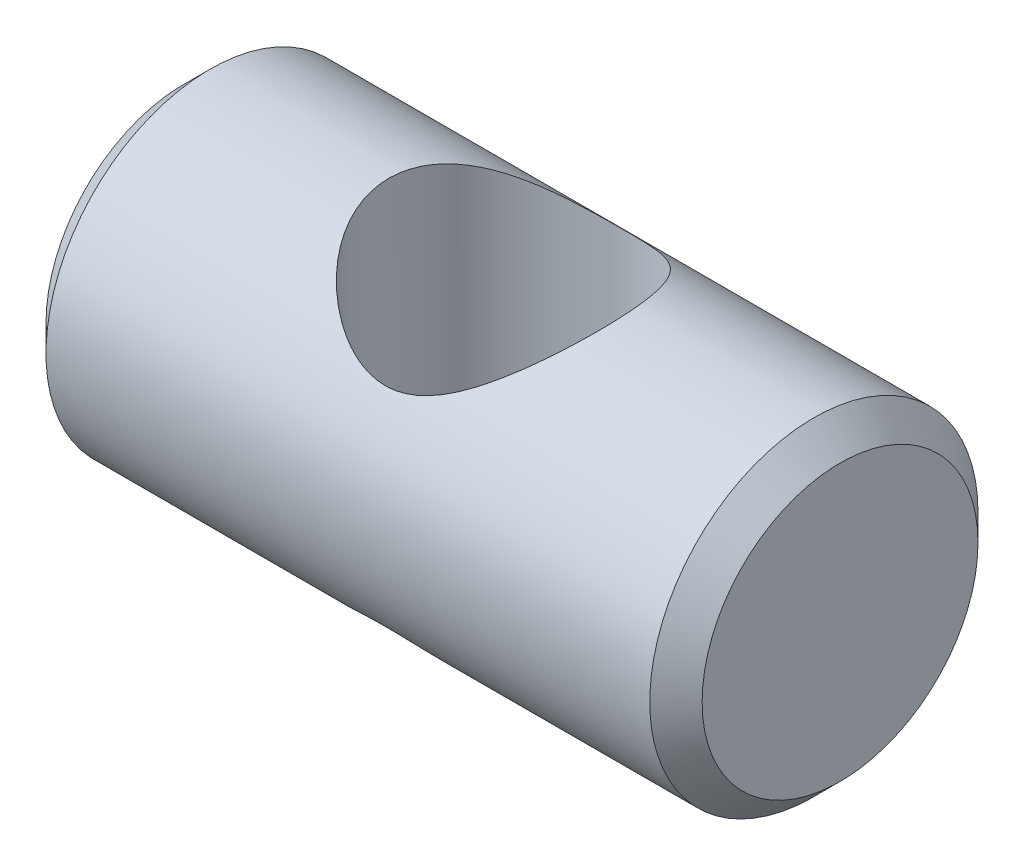
ISO-10303-21;
HEADER;
FILE_DESCRIPTION(('STEP AP214'),'2;1');
FILE_NAME('part.step','',(''),(''),'','','');
FILE_SCHEMA(('AUTOMOTIVE_DESIGN { 1 0 10303 214 1 1 1 1 }'));
ENDSEC;
DATA;
#1=APPLICATION_CONTEXT('core data for automotive mechanical design processes');
#2=APPLICATION_PROTOCOL_DEFINITION('international standard','automotive_design',2000,#1);
#3=PRODUCT_CONTEXT('',#1,'mechanical');
#4=PRODUCT('Part','Part','',(#3));
#5=PRODUCT_RELATED_PRODUCT_CATEGORY('part','',(#4));
#6=PRODUCT_DEFINITION_FORMATION('','',#4);
#7=PRODUCT_DEFINITION_CONTEXT('part definition',#1,'design');
#8=PRODUCT_DEFINITION('design','',#6,#7);
#9=PRODUCT_DEFINITION_SHAPE('','',#8);
#10=(LENGTH_UNIT() NAMED_UNIT(*) SI_UNIT(.MILLI.,.METRE.));
#11=(NAMED_UNIT(*) PLANE_ANGLE_UNIT() SI_UNIT($,.RADIAN.));
#12=(NAMED_UNIT(*) SI_UNIT($,.STERADIAN.) SOLID_ANGLE_UNIT());
#13=UNCERTAINTY_MEASURE_WITH_UNIT(LENGTH_MEASURE(1.E-05),#10,'distance_accuracy_value','');
#14=(GEOMETRIC_REPRESENTATION_CONTEXT(3) GLOBAL_UNCERTAINTY_ASSIGNED_CONTEXT((#13)) GLOBAL_UNIT_ASSIGNED_CONTEXT((#10,
#11,#12)) REPRESENTATION_CONTEXT('',''));
#15=CARTESIAN_POINT('',(0.,0.,0.));
#16=DIRECTION('',(0.,0.,1.));
#17=DIRECTION('',(1.,0.,0.));
#18=AXIS2_PLACEMENT_3D('',#15,#16,#17);
#19=CARTESIAN_POINT('',(9.525,0.,0.));
#20=DIRECTION('',(-1.,0.,0.));
#21=DIRECTION('',(0.,0.,1.));
#22=AXIS2_PLACEMENT_3D('',#19,#20,#21);
#23=CYLINDRICAL_SURFACE('',#22,4.765);
#24=CARTESIAN_POINT('',(-3.42087708051605,-4.765,0.));
#25=CARTESIAN_POINT('',(-3.42696899134863,-4.7649997101109,0.0833627581168182));
#26=CARTESIAN_POINT('',(-3.43001003086423,-4.76280757869707,0.166953392424251));
#27=CARTESIAN_POINT('',(-3.4299899120654,-4.75402028790231,0.333933182408653));
#28=CARTESIAN_POINT('',(-3.42692615604904,-4.74742325494959,0.41732223719261));
#29=CARTESIAN_POINT('',(-3.41478160746824,-4.72989865727235,0.583312250165057));
#30=CARTESIAN_POINT('',(-3.40569315136156,-4.71896558414041,0.665912068503747));
#31=CARTESIAN_POINT('',(-3.38168739143667,-4.69295834085159,0.829610597514772));
#32=CARTESIAN_POINT('',(-3.36676760565251,-4.67788240819801,0.91070865358331));
#33=CARTESIAN_POINT('',(-3.31382161536753,-4.62699847385246,1.15000632689336));
#34=CARTESIAN_POINT('',(-3.26752778272676,-4.58542013528299,1.30524951697123));
#35=CARTESIAN_POINT('',(-3.15544383432779,-4.48962808746058,1.60411463212557));
#36=CARTESIAN_POINT('',(-3.08965416222603,-4.43541466574349,1.74773682156028));
#37=CARTESIAN_POINT('',(-2.93522566350036,-4.31273538578719,2.03259497643689));
#38=CARTESIAN_POINT('',(-2.84518090003159,-4.24347672491827,2.17272279857911));
#39=CARTESIAN_POINT('',(-2.64803347355049,-4.09784606286129,2.43631552731587));
#40=CARTESIAN_POINT('',(-2.54091313456509,-4.02146672501527,2.55976291960052));
#41=CARTESIAN_POINT('',(-2.28757037498761,-3.84950291536883,2.81327393100644));
#42=CARTESIAN_POINT('',(-2.13784494064544,-3.75321839663728,2.93940806717613));
#43=CARTESIAN_POINT('',(-1.89774924473951,-3.61188607024724,3.10885207016274));
#44=CARTESIAN_POINT('',(-1.81509327318893,-3.56527135977744,3.16205944901992));
#45=CARTESIAN_POINT('',(-1.64456461914389,-3.47438917550769,3.26165283895997));
#46=CARTESIAN_POINT('',(-1.55669391813204,-3.43012082209568,3.30804141803447));
#47=CARTESIAN_POINT('',(-1.33801732923479,-3.32784018306176,3.41144333221737));
#48=CARTESIAN_POINT('',(-1.20454764001564,-3.27176419567389,3.46485738281701));
#49=CARTESIAN_POINT('',(-0.927567219273259,-3.17315327144381,3.55539465585279));
#50=CARTESIAN_POINT('',(-0.784080947165172,-3.13058666617785,3.59255605597934));
#51=CARTESIAN_POINT('',(-0.514646140223209,-3.07113542283653,3.64343651296181));
#52=CARTESIAN_POINT('',(-0.389980532152303,-3.05107413064414,3.66010628533956));
#53=CARTESIAN_POINT('',(-0.13805144197163,-3.02761567970702,3.67954153570878));
#54=CARTESIAN_POINT('',(-0.010790737951865,-3.02420155283186,3.68232117171679));
#55=CARTESIAN_POINT('',(0.242449329866106,-3.03458366659267,3.67376621747767));
#56=CARTESIAN_POINT('',(0.368429244158409,-3.04837216824954,3.66243797397314));
#57=CARTESIAN_POINT('',(0.615927376424317,-3.09094772918142,3.62657095184853));
#58=CARTESIAN_POINT('',(0.737438661719832,-3.11975712134959,3.60201250089043));
#59=CARTESIAN_POINT('',(1.02486117239319,-3.20358122773375,3.52797021750044));
#60=CARTESIAN_POINT('',(1.18741075414518,-3.26453704351351,3.47231020523667));
#61=CARTESIAN_POINT('',(1.498121783823,-3.39961296516166,3.34017866781708));
#62=CARTESIAN_POINT('',(1.64623815847782,-3.47377238661047,3.2636446149314));
#63=CARTESIAN_POINT('',(1.87825971607124,-3.60054284241464,3.12200897105521));
#64=CARTESIAN_POINT('',(1.9664324955114,-3.65156363596669,3.06234750531042));
#65=CARTESIAN_POINT('',(2.13658829521524,-3.75440484501345,2.93536296354977));
#66=CARTESIAN_POINT('',(2.21856944344932,-3.80622549668558,2.86803758566651));
#67=CARTESIAN_POINT('',(2.4548169203279,-3.96070606463684,2.65493557738645));
#68=CARTESIAN_POINT('',(2.59972905493882,-4.06258137631192,2.4978237985218));
#69=CARTESIAN_POINT('',(2.83706621766583,-4.23718725327564,2.18575837138569));
#70=CARTESIAN_POINT('',(2.93424360521689,-4.31186637762032,2.03548298499758));
#71=CARTESIAN_POINT('',(3.10568912436017,-4.44824656330391,1.71702572980925));
#72=CARTESIAN_POINT('',(3.17999040299218,-4.50996636079323,1.54887024912961));
#73=CARTESIAN_POINT('',(3.29263516387729,-4.60778480850806,1.22389848309853));
#74=CARTESIAN_POINT('',(3.33468022800881,-4.64632732736096,1.06910753325384));
#75=CARTESIAN_POINT('',(3.39687013419293,-4.70801774696666,0.752190984217971));
#76=CARTESIAN_POINT('',(3.4170259792185,-4.73117337991453,0.590069112764687));
#77=CARTESIAN_POINT('',(3.43390286080123,-4.7606051003247,0.262598143568303));
#78=CARTESIAN_POINT('',(3.43055828056669,-4.76683385814853,0.0972412962651645));
#79=CARTESIAN_POINT('',(3.40010195996678,-4.76222706928004,-0.231024129353292));
#80=CARTESIAN_POINT('',(3.37298745129903,-4.75138953488968,-0.393932420256085));
#81=CARTESIAN_POINT('',(3.29795083571309,-4.71498049061455,-0.705514268669748));
#82=CARTESIAN_POINT('',(3.25098003249397,-4.69006694126301,-0.854498752183594));
#83=CARTESIAN_POINT('',(3.13840780618742,-4.6283363468626,-1.14256413370517));
#84=CARTESIAN_POINT('',(3.07280276883643,-4.59151699239254,-1.28164310390504));
#85=CARTESIAN_POINT('',(2.91796402171938,-4.50478911028579,-1.5605913242394));
#86=CARTESIAN_POINT('',(2.82706121692328,-4.45396042558585,-1.6992420339739));
#87=CARTESIAN_POINT('',(2.62789389216064,-4.34533105232054,-1.96045324775842));
#88=CARTESIAN_POINT('',(2.51961335554432,-4.28752394420402,-2.08299871660834));
#89=CARTESIAN_POINT('',(2.26753986981794,-4.15886196775128,-2.33061071233595));
#90=CARTESIAN_POINT('',(2.12084350362776,-4.08747815085455,-2.4524560274696));
#91=CARTESIAN_POINT('',(1.80818256348861,-3.94818744226299,-2.67091966387117));
#92=CARTESIAN_POINT('',(1.64221717999394,-3.88028069682256,-2.76753692468302));
#93=CARTESIAN_POINT('',(1.32363316444147,-3.76775877390234,-2.91829752704228));
#94=CARTESIAN_POINT('',(1.17388770573105,-3.72114907301219,-2.97693831230802));
#95=CARTESIAN_POINT('',(0.94182658133829,-3.66180847873486,-3.04915600293589));
#96=CARTESIAN_POINT('',(0.863255129060431,-3.64379412637323,-3.0706008978109));
#97=CARTESIAN_POINT('',(0.703992654043785,-3.61197174564401,-3.10797188341904));
#98=CARTESIAN_POINT('',(0.62330269473567,-3.59816164910818,-3.12390068817333));
#99=CARTESIAN_POINT('',(0.459495462666014,-3.57524455910332,-3.15010468685879));
#100=CARTESIAN_POINT('',(0.376361962516611,-3.5661861203942,-3.16032158062367));
#101=CARTESIAN_POINT('',(0.209195138832908,-3.55344451616001,-3.17464168800661));
#102=CARTESIAN_POINT('',(0.125162274904953,-3.54975872585817,-3.17874788699032));
#103=CARTESIAN_POINT('',(-0.0430393452037676,-3.54795587812489,-3.18076053743013));
#104=CARTESIAN_POINT('',(-0.127208095972437,-3.54983860412504,-3.17866722999483));
#105=CARTESIAN_POINT('',(-0.29484062899608,-3.55905933774995,-3.16833758034575));
#106=CARTESIAN_POINT('',(-0.378304441298768,-3.56639711165655,-3.16010150131517));
#107=CARTESIAN_POINT('',(-0.604314657609785,-3.59341005189328,-3.129430196119));
#108=CARTESIAN_POINT('',(-0.745494317394036,-3.61818171011667,-3.10101793603989));
#109=CARTESIAN_POINT('',(-1.02069983126741,-3.67972750014127,-3.02771937958645));
#110=CARTESIAN_POINT('',(-1.1547183301723,-3.71651370639189,-2.98281650470617));
#111=CARTESIAN_POINT('',(-1.46853642894096,-3.8153502491925,-2.8560768918245));
#112=CARTESIAN_POINT('',(-1.64398166227299,-3.88152734494911,-2.76664814536404));
#113=CARTESIAN_POINT('',(-1.97551522842484,-4.02033820070584,-2.56077346334119));
#114=CARTESIAN_POINT('',(-2.13156938380249,-4.09298298410994,-2.44428083509274));
#115=CARTESIAN_POINT('',(-2.42421216807333,-4.2373970566927,-2.18450650401399));
#116=CARTESIAN_POINT('',(-2.56052605726515,-4.30914323590253,-2.04090097393914));
#117=CARTESIAN_POINT('',(-2.80802181758102,-4.44318432752427,-1.72973058522059));
#118=CARTESIAN_POINT('',(-2.91923707314103,-4.50549175797245,-1.56219804304703));
#119=CARTESIAN_POINT('',(-3.09396462152009,-4.60338031575656,-1.23969583506405));
#120=CARTESIAN_POINT('',(-3.16252149709776,-4.64178783933997,-1.08834922542924));
#121=CARTESIAN_POINT('',(-3.24875451241662,-4.68864069192958,-0.853387810710919));
#122=CARTESIAN_POINT('',(-3.27471971164357,-4.70245945854321,-0.773800863355168));
#123=CARTESIAN_POINT('',(-3.32087000112459,-4.72618391319332,-0.612411306870996));
#124=CARTESIAN_POINT('',(-3.34105760799584,-4.73609130567107,-0.530609679466056));
#125=CARTESIAN_POINT('',(-3.37353939001354,-4.75084997254152,-0.374335243630175));
#126=CARTESIAN_POINT('',(-3.38645258471521,-4.75613339853629,-0.300030947704157));
#127=CARTESIAN_POINT('',(-3.40736829831093,-4.76320900575073,-0.150546671086999));
#128=CARTESIAN_POINT('',(-3.41536951590209,-4.76500026208246,-0.075366463716097));
#129=CARTESIAN_POINT('',(-3.42087708051605,-4.765,0.));
#130=B_SPLINE_CURVE_WITH_KNOTS('',3,(#24,#25,#26,#27,#28,#29,#30,#31,#32,#33,#34,#35,#36,#37,
#38,#39,#40,#41,#42,#43,#44,#45,#46,#47,#48,#49,#50,#51,#52,#53,#54,#55,#56,#57,#58,#59,#60,#61,
#62,#63,#64,#65,#66,#67,#68,#69,#70,#71,#72,#73,#74,#75,#76,#77,#78,#79,#80,#81,#82,#83,#84,#85,
#86,#87,#88,#89,#90,#91,#92,#93,#94,#95,#96,#97,#98,#99,#100,#101,#102,#103,#104,#105,#106,#107,
#108,#109,#110,#111,#112,#113,#114,#115,#116,#117,#118,#119,#120,#121,#122,#123,#124,#125,#126,
#127,#128,#129),.UNSPECIFIED.,.T.,.F.,(4,2,2,2,2,2,2,2,2,2,2,2,2,2,2,2,2,2,2,2,2,2,2,2,2,2,2,2,
2,2,2,2,2,2,2,2,2,2,2,2,2,2,2,2,2,2,2,2,2,2,2,2,4),(0.,0.250678148817341,0.501462988541287,
0.752567445437253,1.00377889552888,1.50309474088369,2.00239922444642,2.54160992918404,
3.08138247258981,3.73300244855075,4.05909733145616,4.38506908912952,4.84654436743379,
5.30692973453839,5.68734604359481,6.06737452056514,6.44723209503533,6.82765605484285,
7.37157480546313,7.91714109472133,8.27090631470675,8.62477807035776,9.33119791439566,
9.91077027397039,10.4894988486046,10.9822712500665,11.4747958366297,11.9686961727678,
12.4626540373564,12.9352342359093,13.4079061579591,13.9261848288361,14.4449439577641,
15.0533142145202,15.6617100398796,16.1619385675779,16.4119146790501,16.6617676221917,
16.9141262556176,17.1663615593023,17.4185870532858,17.6708017414467,18.1072101440206,
18.5440584873629,19.1640002904501,19.7850197135797,20.4139885307568,21.0421157411608,
21.5513660687497,21.8056438515067,22.059810706191,22.2863833912941,22.5130160751694),.UNSPECIFIED.);
#131=CARTESIAN_POINT('',(-3.42087708051605,-4.765,0.));
#132=VERTEX_POINT('',#131);
#133=EDGE_CURVE('E10',#132,#132,#130,.T.);
#134=ORIENTED_EDGE('',*,*,#133,.T.);
#135=EDGE_LOOP('',(#134));
#136=FACE_BOUND('',#135,.T.);
#137=CARTESIAN_POINT('',(0.,3.02701585724291,3.68));
#138=CARTESIAN_POINT('',(-0.0785672773316466,3.02701614791727,3.67999984364138));
#139=CARTESIAN_POINT('',(-0.157136135576355,3.03031605642996,3.67729277636747));
#140=CARTESIAN_POINT('',(-0.313369541449519,3.04330147157753,3.66655295600809));
#141=CARTESIAN_POINT('',(-0.391034010912772,3.05298752605126,3.65851974601636));
#142=CARTESIAN_POINT('',(-0.544942339151606,3.07820352988238,3.63732812874269));
#143=CARTESIAN_POINT('',(-0.621180877977561,3.09375201630091,3.62415345944192));
#144=CARTESIAN_POINT('',(-0.771468880528867,3.12988210454059,3.59299821855179));
#145=CARTESIAN_POINT('',(-0.845516665983407,3.15046745848851,3.57501406328682));
#146=CARTESIAN_POINT('',(-1.09433047382612,3.22791462831318,3.50587087765695));
#147=CARTESIAN_POINT('',(-1.26309282362243,3.2948386580286,3.44382003292069));
#148=CARTESIAN_POINT('',(-1.50370711041474,3.40467601246938,3.33408533723919));
#149=CARTESIAN_POINT('',(-1.58189244838754,3.44290479326835,3.29468500807198));
#150=CARTESIAN_POINT('',(-1.73423285237257,3.52148653298938,3.21055545325705));
#151=CARTESIAN_POINT('',(-1.80838881793449,3.56183901380659,3.16582742418489));
#152=CARTESIAN_POINT('',(-2.02850482582811,3.68672600847628,3.02153691887044));
#153=CARTESIAN_POINT('',(-2.16807869449587,3.77315168849593,2.9137218740972));
#154=CARTESIAN_POINT('',(-2.42959010373283,3.94426933228633,2.67754924945123));
#155=CARTESIAN_POINT('',(-2.55153658554773,4.0289621561759,2.54920215427041));
#156=CARTESIAN_POINT('',(-2.77693730786715,4.1919505214112,2.27132648174838));
#157=CARTESIAN_POINT('',(-2.88023478105728,4.27018907543984,2.12163570850646));
#158=CARTESIAN_POINT('',(-3.06369900830999,4.41409842691616,1.80316374111449));
#159=CARTESIAN_POINT('',(-3.14388622560065,4.47978032533083,1.63439962117957));
#160=CARTESIAN_POINT('',(-3.26635689009236,4.58439476517905,1.30881127520956));
#161=CARTESIAN_POINT('',(-3.3126324755552,4.62591646772975,1.15433056577145));
#162=CARTESIAN_POINT('',(-3.38325654959983,4.69367027218436,0.837202280830254));
#163=CARTESIAN_POINT('',(-3.40762001451853,4.7199128126465,0.674560363681942));
#164=CARTESIAN_POINT('',(-3.43267527752513,4.75538994748078,0.345016918949486));
#165=CARTESIAN_POINT('',(-3.43328564995364,4.76456593536209,0.178102701594286));
#166=CARTESIAN_POINT('',(-3.41018166140548,4.76540378920208,-0.154080808504466));
#167=CARTESIAN_POINT('',(-3.38646547727926,4.75706434242047,-0.319349977022772));
#168=CARTESIAN_POINT('',(-3.31775156953333,4.72510260499364,-0.634317782486346));
#169=CARTESIAN_POINT('',(-3.27397352746067,4.70233080305011,-0.784375176401478));
#170=CARTESIAN_POINT('',(-3.16750864597913,4.64450941494238,-1.07505429218324));
#171=CARTESIAN_POINT('',(-3.10481828431147,4.60945754152293,-1.21567425043883));
#172=CARTESIAN_POINT('',(-2.95652856255593,4.52638674091888,-1.49677788855974));
#173=CARTESIAN_POINT('',(-2.86942133720827,4.47751111873768,-1.63620711351601));
#174=CARTESIAN_POINT('',(-2.67788120319372,4.37232420780869,-1.89951272145431));
#175=CARTESIAN_POINT('',(-2.57343424063936,4.31600689517522,-2.02337634423388));
#176=CARTESIAN_POINT('',(-2.32992989714121,4.18996971318213,-2.27426780979749));
#177=CARTESIAN_POINT('',(-2.18800876851398,4.11960732735628,-2.39819784816123));
#178=CARTESIAN_POINT('',(-1.88505782163776,3.98107848473248,-2.62174133186739));
#179=CARTESIAN_POINT('',(-1.72402241690679,3.91291267736107,-2.72134764203992));
#180=CARTESIAN_POINT('',(-1.40961518716303,3.79636450990898,-2.881168849186));
#181=CARTESIAN_POINT('',(-1.25863725138286,3.74654731116981,-2.94503209171547));
#182=CARTESIAN_POINT('',(-0.945527440392476,3.66060402226399,-3.05121747931762));
#183=CARTESIAN_POINT('',(-0.783414037013453,3.62445587601066,-3.09357436476774));
#184=CARTESIAN_POINT('',(-0.533813056438613,3.58476149841442,-3.13928376884266));
#185=CARTESIAN_POINT('',(-0.449028547115524,3.57393161480045,-3.15156761613341));
#186=CARTESIAN_POINT('',(-0.278275024285711,3.55780077117141,-3.16976872881678));
#187=CARTESIAN_POINT('',(-0.192306660171834,3.5524968934398,-3.17568935402606));
#188=CARTESIAN_POINT('',(-0.020032770904315,3.54772147962291,-3.18102355866001));
#189=CARTESIAN_POINT('',(0.0662726316081444,3.54824798964232,-3.18043931801256));
#190=CARTESIAN_POINT('',(0.238338872801625,3.55508375410915,-3.17279435887041));
#191=CARTESIAN_POINT('',(0.324099748085624,3.56139261563451,-3.16573408043507));
#192=CARTESIAN_POINT('',(0.553401842306173,3.58576306843395,-3.13816835119393));
#193=CARTESIAN_POINT('',(0.69573919740344,3.60894237647337,-3.11173256017326));
#194=CARTESIAN_POINT('',(0.973480788870408,3.6678298405413,-3.04208625520151));
#195=CARTESIAN_POINT('',(1.10887734054378,3.70355155394913,-2.99885758403296));
#196=CARTESIAN_POINT('',(1.42379146726814,3.7997001514418,-2.87675019956371));
#197=CARTESIAN_POINT('',(1.59919673865542,3.86428769996493,-2.79052654374781));
#198=CARTESIAN_POINT('',(1.93113815119942,4.00059813210694,-2.59133845951309));
#199=CARTESIAN_POINT('',(2.08764088718698,4.07233325050109,-2.47832770642991));
#200=CARTESIAN_POINT('',(2.38199709911893,4.21579037939226,-2.22570370446708));
#201=CARTESIAN_POINT('',(2.51955338419097,4.28749766673045,-2.08573466326166));
#202=CARTESIAN_POINT('',(2.77028243502779,4.42234806198233,-1.78201502187867));
#203=CARTESIAN_POINT('',(2.88349257282064,4.48550424008068,-1.61830152645774));
#204=CARTESIAN_POINT('',(3.06402610957439,4.58658548395503,-1.30045140866569));
#205=CARTESIAN_POINT('',(3.13591982023922,4.62699541781642,-1.1497087789086));
#206=CARTESIAN_POINT('',(3.25766051296821,4.69370617156705,-0.836599849304389));
#207=CARTESIAN_POINT('',(3.30752205037566,4.7200163088041,-0.674241306034806));
#208=CARTESIAN_POINT('',(3.3829870904449,4.75572615385405,-0.341241432427482));
#209=CARTESIAN_POINT('',(3.40846923089666,4.7650414665297,-0.170563063438744));
#210=CARTESIAN_POINT('',(3.4334390909829,4.76495829995348,0.172677006169809));
#211=CARTESIAN_POINT('',(3.43293306367628,4.7555643228997,0.345238243758836));
#212=CARTESIAN_POINT('',(3.40754400048731,4.71998636563285,0.67212649572784));
#213=CARTESIAN_POINT('',(3.38468468821344,4.69525837988108,0.826779473459491));
#214=CARTESIAN_POINT('',(3.31910619707247,4.63193340521078,1.12882616508402));
#215=CARTESIAN_POINT('',(3.27638180384756,4.59333277548538,1.27621796175838));
#216=CARTESIAN_POINT('',(3.17042951924722,4.50215126554465,1.5686260572414));
#217=CARTESIAN_POINT('',(3.10621371599284,4.44892473542071,1.71307815224114));
#218=CARTESIAN_POINT('',(2.96073945861412,4.33272638873523,1.98874620073681));
#219=CARTESIAN_POINT('',(2.87947919610232,4.26975353829207,2.11996074756245));
#220=CARTESIAN_POINT('',(2.68651050838254,4.12556821291774,2.39003735747662));
#221=CARTESIAN_POINT('',(2.57196063848181,4.04309554925752,2.52618739114483));
#222=CARTESIAN_POINT('',(2.32447412944916,3.87408431941462,2.77844859407009));
#223=CARTESIAN_POINT('',(2.19149095139184,3.78753584009048,2.89450731580785));
#224=CARTESIAN_POINT('',(1.96595276183287,3.65130486353125,3.06263487303052));
#225=CARTESIAN_POINT('',(1.87886470860019,3.60090149373494,3.12157066922301));
#226=CARTESIAN_POINT('',(1.69862262017005,3.50236607543005,3.23173475735497));
#227=CARTESIAN_POINT('',(1.60546616441238,3.45423494663789,3.28295994638551));
#228=CARTESIAN_POINT('',(1.41335402823623,3.36225362869259,3.37709887635029));
#229=CARTESIAN_POINT('',(1.31441341048654,3.31839304937429,3.4200330530899));
#230=CARTESIAN_POINT('',(1.11061583662532,3.23713845030014,3.49704051581634));
#231=CARTESIAN_POINT('',(1.00576424358736,3.19973868995705,3.53112168161428));
#232=CARTESIAN_POINT('',(0.826860618617418,3.1451674862639,3.57966454279998));
#233=CARTESIAN_POINT('',(0.754330914941613,3.12542579098052,3.59686794878708));
#234=CARTESIAN_POINT('',(0.607204587985835,3.09080711138969,3.62665947956898));
#235=CARTESIAN_POINT('',(0.532609008476296,3.07592771737776,3.63924989089071));
#236=CARTESIAN_POINT('',(0.38209665983941,3.05181598122002,3.65949364139542));
#237=CARTESIAN_POINT('',(0.306185151895193,3.04256489437812,3.66716337327478));
#238=CARTESIAN_POINT('',(0.153516252829605,3.03016475948479,3.67741657137031));
#239=CARTESIAN_POINT('',(0.0767588809019638,3.02701557325904,3.68000015275969));
#240=CARTESIAN_POINT('',(0.,3.02701585724291,3.68));
#241=B_SPLINE_CURVE_WITH_KNOTS('',3,(#137,#138,#139,#140,#141,#142,#143,#144,#145,#146,#147,
#148,#149,#150,#151,#152,#153,#154,#155,#156,#157,#158,#159,#160,#161,#162,#163,#164,#165,#166,
#167,#168,#169,#170,#171,#172,#173,#174,#175,#176,#177,#178,#179,#180,#181,#182,#183,#184,#185,
#186,#187,#188,#189,#190,#191,#192,#193,#194,#195,#196,#197,#198,#199,#200,#201,#202,#203,#204,
#205,#206,#207,#208,#209,#210,#211,#212,#213,#214,#215,#216,#217,#218,#219,#220,#221,#222,#223,
#224,#225,#226,#227,#228,#229,#230,#231,#232,#233,#234,#235,#236,#237,#238,#239,#240),
.UNSPECIFIED.,.T.,.F.,(4,2,2,2,2,2,2,2,2,2,2,2,2,2,2,2,2,2,2,2,2,2,2,2,2,2,2,2,2,2,2,2,2,2,2,2,
2,2,2,2,2,2,2,2,2,2,2,2,2,2,2,4),(0.,0.235591708988226,0.471203630963838,0.707566894291256,
0.944106771258296,1.51591397043087,1.80236618274396,2.08875418016066,2.67592975620556,
3.26280644257576,3.85440755326201,4.44548320346413,4.94292664174491,5.44002983205938,
5.93883694376225,6.43768144120931,6.9095606777859,7.38152785217115,7.89413675044232,
8.40716316586385,9.00813916387887,9.60929124216605,10.1214610992978,10.6328009675269,
10.8914987801306,11.1500599316432,11.4085344360666,11.6669913779457,12.1048085655683,
12.5431004643861,13.1573710774192,13.7727118402267,14.3968121302921,15.0199474601663,
15.5333029695888,16.0463188267164,16.5618754223646,17.077307969612,17.550023970907,
18.0228641248864,18.5213957266873,19.0199802486027,19.6062313855034,20.1939905554461,
20.5434646283834,20.8930789631276,21.2418202453876,21.5902500511245,21.8213124314337,
22.0522601254179,22.2824343920731,22.5126034464923),.UNSPECIFIED.);
#242=CARTESIAN_POINT('',(0.,3.02701585724291,3.68));
#243=VERTEX_POINT('',#242);
#244=EDGE_CURVE('E43',#243,#243,#241,.T.);
#245=ORIENTED_EDGE('',*,*,#244,.T.);
#246=EDGE_LOOP('',(#245));
#247=FACE_BOUND('',#246,.T.);
#248=CARTESIAN_POINT('',(-8.76499999999999,0.,0.));
#249=DIRECTION('',(1.,0.,0.));
#250=DIRECTION('',(0.,0.,-1.));
#251=AXIS2_PLACEMENT_3D('',#248,#249,#250);
#252=CIRCLE('',#251,4.765);
#253=CARTESIAN_POINT('',(-8.76499999999999,0.,-4.765));
#254=VERTEX_POINT('',#253);
#255=EDGE_CURVE('E84',#254,#254,#252,.T.);
#256=ORIENTED_EDGE('',*,*,#255,.T.);
#257=EDGE_LOOP('',(#256));
#258=FACE_BOUND('',#257,.T.);
#259=CARTESIAN_POINT('',(8.76500000000001,0.,0.));
#260=DIRECTION('',(1.,0.,0.));
#261=DIRECTION('',(0.,0.,-1.));
#262=AXIS2_PLACEMENT_3D('',#259,#260,#261);
#263=CIRCLE('',#262,4.765);
#264=CARTESIAN_POINT('',(8.76500000000001,0.,-4.765));
#265=VERTEX_POINT('',#264);
#266=EDGE_CURVE('E87',#265,#265,#263,.F.);
#267=ORIENTED_EDGE('',*,*,#266,.T.);
#268=EDGE_LOOP('',(#267));
#269=FACE_BOUND('',#268,.T.);
#270=ADVANCED_FACE('F31',(#136,#247,#258,#269),#23,.T.);
#271=CARTESIAN_POINT('',(9.525,0.,0.));
#272=DIRECTION('',(1.,0.,0.));
#273=DIRECTION('',(0.,0.,-1.));
#274=AXIS2_PLACEMENT_3D('',#271,#272,#273);
#275=PLANE('',#274);
#276=CARTESIAN_POINT('',(9.525,0.,0.));
#277=DIRECTION('',(1.,0.,0.));
#278=DIRECTION('',(0.,0.,-1.));
#279=AXIS2_PLACEMENT_3D('',#276,#277,#278);
#280=CIRCLE('',#279,4.00500000000001);
#281=CARTESIAN_POINT('',(9.525,0.,-4.00500000000001));
#282=VERTEX_POINT('',#281);
#283=EDGE_CURVE('E47',#282,#282,#280,.T.);
#284=ORIENTED_EDGE('',*,*,#283,.T.);
#285=EDGE_LOOP('',(#284));
#286=FACE_BOUND('',#285,.T.);
#287=ADVANCED_FACE('F64',(#286),#275,.T.);
#288=CARTESIAN_POINT('',(-9.525,0.,0.));
#289=DIRECTION('',(1.,0.,0.));
#290=DIRECTION('',(0.,0.,-1.));
#291=AXIS2_PLACEMENT_3D('',#288,#289,#290);
#292=PLANE('',#291);
#293=CARTESIAN_POINT('',(-9.525,0.,0.));
#294=DIRECTION('',(1.,0.,0.));
#295=DIRECTION('',(0.,0.,-1.));
#296=AXIS2_PLACEMENT_3D('',#293,#294,#295);
#297=CIRCLE('',#296,4.00499999999998);
#298=CARTESIAN_POINT('',(-9.525,0.,-4.00499999999998));
#299=VERTEX_POINT('',#298);
#300=EDGE_CURVE('E51',#299,#299,#297,.F.);
#301=ORIENTED_EDGE('',*,*,#300,.T.);
#302=EDGE_LOOP('',(#301));
#303=FACE_BOUND('',#302,.T.);
#304=ADVANCED_FACE('F67',(#303),#292,.F.);
#305=CARTESIAN_POINT('',(-8.76499999999999,0.,0.));
#306=DIRECTION('',(1.,0.,0.));
#307=DIRECTION('',(0.,0.,-1.));
#308=AXIS2_PLACEMENT_3D('',#305,#306,#307);
#309=CONICAL_SURFACE('',#308,4.765,0.785398163397451);
#310=ORIENTED_EDGE('',*,*,#300,.F.);
#311=EDGE_LOOP('',(#310));
#312=FACE_BOUND('',#311,.T.);
#313=ORIENTED_EDGE('',*,*,#255,.F.);
#314=EDGE_LOOP('',(#313));
#315=FACE_BOUND('',#314,.T.);
#316=ADVANCED_FACE('F70',(#312,#315),#309,.T.);
#317=CARTESIAN_POINT('',(9.525,0.,0.));
#318=DIRECTION('',(-1.,0.,0.));
#319=DIRECTION('',(0.,0.,1.));
#320=AXIS2_PLACEMENT_3D('',#317,#318,#319);
#321=CONICAL_SURFACE('',#320,4.00500000000001,0.785398163397448);
#322=ORIENTED_EDGE('',*,*,#266,.F.);
#323=EDGE_LOOP('',(#322));
#324=FACE_BOUND('',#323,.T.);
#325=ORIENTED_EDGE('',*,*,#283,.F.);
#326=EDGE_LOOP('',(#325));
#327=FACE_BOUND('',#326,.T.);
#328=ADVANCED_FACE('F33',(#324,#327),#321,.T.);
#329=CARTESIAN_POINT('',(0.,-4.765,0.25));
#330=DIRECTION('',(0.,1.,0.));
#331=DIRECTION('',(0.,0.,1.));
#332=AXIS2_PLACEMENT_3D('',#329,#330,#331);
#333=CYLINDRICAL_SURFACE('',#332,3.43);
#334=ORIENTED_EDGE('',*,*,#244,.F.);
#335=EDGE_LOOP('',(#334));
#336=FACE_BOUND('',#335,.T.);
#337=ORIENTED_EDGE('',*,*,#133,.F.);
#338=EDGE_LOOP('',(#337));
#339=FACE_BOUND('',#338,.T.);
#340=ADVANCED_FACE('F59',(#336,#339),#333,.F.);
#341=CLOSED_SHELL('',(#270,#287,#304,#316,#328,#340));
#342=MANIFOLD_SOLID_BREP('B2',#341);
#343=ADVANCED_BREP_SHAPE_REPRESENTATION('',(#18,#342),#14);
#344=SHAPE_DEFINITION_REPRESENTATION(#9,#343);
ENDSEC;
END-ISO-10303-21;
